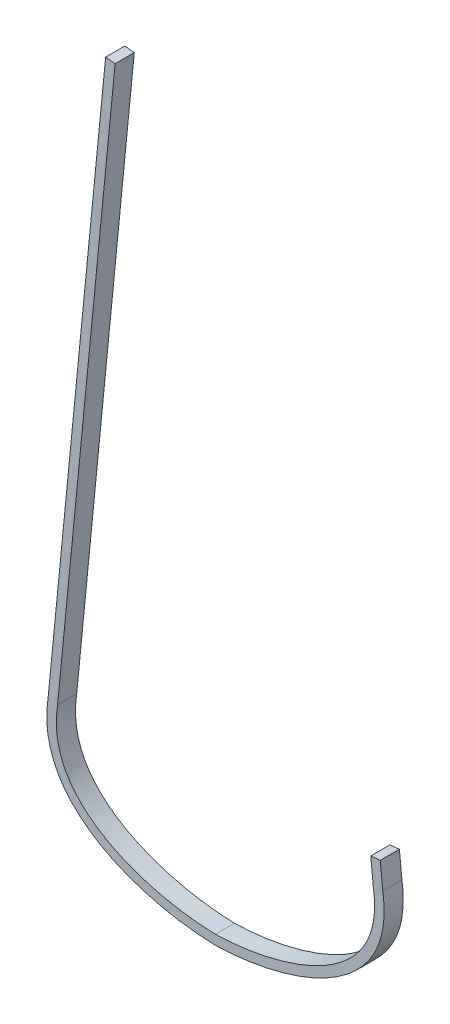
ISO-10303-21;
HEADER;
FILE_DESCRIPTION(('STEP AP214'),'2;1');
FILE_NAME('part.step','',(''),(''),'','','');
FILE_SCHEMA(('AUTOMOTIVE_DESIGN { 1 0 10303 214 1 1 1 1 }'));
ENDSEC;
DATA;
#1=APPLICATION_CONTEXT('core data for automotive mechanical design processes');
#2=APPLICATION_PROTOCOL_DEFINITION('international standard','automotive_design',2000,#1);
#3=PRODUCT_CONTEXT('',#1,'mechanical');
#4=PRODUCT('Part','Part','',(#3));
#5=PRODUCT_RELATED_PRODUCT_CATEGORY('part','',(#4));
#6=PRODUCT_DEFINITION_FORMATION('','',#4);
#7=PRODUCT_DEFINITION_CONTEXT('part definition',#1,'design');
#8=PRODUCT_DEFINITION('design','',#6,#7);
#9=PRODUCT_DEFINITION_SHAPE('','',#8);
#10=(LENGTH_UNIT() NAMED_UNIT(*) SI_UNIT(.MILLI.,.METRE.));
#11=(NAMED_UNIT(*) PLANE_ANGLE_UNIT() SI_UNIT($,.RADIAN.));
#12=(NAMED_UNIT(*) SI_UNIT($,.STERADIAN.) SOLID_ANGLE_UNIT());
#13=UNCERTAINTY_MEASURE_WITH_UNIT(LENGTH_MEASURE(1.E-05),#10,'distance_accuracy_value','');
#14=(GEOMETRIC_REPRESENTATION_CONTEXT(3) GLOBAL_UNCERTAINTY_ASSIGNED_CONTEXT((#13)) GLOBAL_UNIT_ASSIGNED_CONTEXT((#10,
#11,#12)) REPRESENTATION_CONTEXT('',''));
#15=CARTESIAN_POINT('',(0.,0.,0.));
#16=DIRECTION('',(0.,0.,1.));
#17=DIRECTION('',(1.,0.,0.));
#18=AXIS2_PLACEMENT_3D('',#15,#16,#17);
#19=CARTESIAN_POINT('',(0.,0.,19.05));
#20=CARTESIAN_POINT('',(73.6665806217367,1.74067599176395,19.05));
#21=CARTESIAN_POINT('',(181.188092360691,36.2008356091117,19.05));
#22=CARTESIAN_POINT('',(166.6875,130.175,19.05));
#23=B_SPLINE_CURVE_WITH_KNOTS('',3,(#19,#20,#21,#22),.UNSPECIFIED.,.F.,.F.,(4,4),(0.,1.),.UNSPECIFIED.);
#24=DIRECTION('',(0.,0.,-1.));
#25=VECTOR('',#24,1.);
#26=SURFACE_OF_LINEAR_EXTRUSION('',#23,#25);
#27=CARTESIAN_POINT('',(0.,0.,0.));
#28=CARTESIAN_POINT('',(73.6665806217367,1.74067599176395,0.));
#29=CARTESIAN_POINT('',(181.188092360691,36.2008356091117,0.));
#30=CARTESIAN_POINT('',(166.6875,130.175,0.));
#31=B_SPLINE_CURVE_WITH_KNOTS('',3,(#27,#28,#29,#30),.UNSPECIFIED.,.F.,.F.,(4,4),(0.,1.),.UNSPECIFIED.);
#32=CARTESIAN_POINT('',(0.,0.,0.));
#33=VERTEX_POINT('',#32);
#34=CARTESIAN_POINT('',(166.6875,130.175,0.));
#35=VERTEX_POINT('',#34);
#36=EDGE_CURVE('E145',#33,#35,#31,.T.);
#37=ORIENTED_EDGE('',*,*,#36,.T.);
#38=DIRECTION('',(0.,0.,-1.));
#39=VECTOR('',#38,1.);
#40=CARTESIAN_POINT('',(166.6875,130.175,19.05));
#41=LINE('',#40,#39);
#42=CARTESIAN_POINT('',(166.6875,130.175,19.05));
#43=VERTEX_POINT('',#42);
#44=EDGE_CURVE('E11',#43,#35,#41,.T.);
#45=ORIENTED_EDGE('',*,*,#44,.F.);
#46=CARTESIAN_POINT('',(0.,0.,19.05));
#47=VERTEX_POINT('',#46);
#48=EDGE_CURVE('E194',#47,#43,#23,.T.);
#49=ORIENTED_EDGE('',*,*,#48,.F.);
#50=DIRECTION('',(0.,0.,-1.));
#51=VECTOR('',#50,1.);
#52=CARTESIAN_POINT('',(0.,0.,19.05));
#53=LINE('',#52,#51);
#54=EDGE_CURVE('E138',#47,#33,#53,.T.);
#55=ORIENTED_EDGE('',*,*,#54,.T.);
#56=EDGE_LOOP('',(#37,#45,#49,#55));
#57=FACE_BOUND('',#56,.T.);
#58=ADVANCED_FACE('F33',(#57),#26,.F.);
#59=CARTESIAN_POINT('',(166.6875,130.175,19.05));
#60=DIRECTION('',(-0.995175000159784,-0.0981158450861778,0.));
#61=DIRECTION('',(0.0981158450861778,-0.995175000159784,0.));
#62=AXIS2_PLACEMENT_3D('',#59,#60,#61);
#63=PLANE('',#62);
#64=DIRECTION('',(-0.0981158450861778,0.995175000159783,0.));
#65=VECTOR('',#64,1.);
#66=CARTESIAN_POINT('',(166.6875,130.175,0.));
#67=LINE('',#66,#65);
#68=CARTESIAN_POINT('',(164.195357534811,155.452445004058,0.));
#69=VERTEX_POINT('',#68);
#70=EDGE_CURVE('E236',#35,#69,#67,.T.);
#71=ORIENTED_EDGE('',*,*,#70,.T.);
#72=DIRECTION('',(0.,0.,-1.));
#73=VECTOR('',#72,1.);
#74=CARTESIAN_POINT('',(164.195357534811,155.452445004058,19.05));
#75=LINE('',#74,#73);
#76=CARTESIAN_POINT('',(164.195357534811,155.452445004058,19.05));
#77=VERTEX_POINT('',#76);
#78=EDGE_CURVE('E42',#77,#69,#75,.T.);
#79=ORIENTED_EDGE('',*,*,#78,.F.);
#80=DIRECTION('',(-0.0981158450861778,0.995175000159783,0.));
#81=VECTOR('',#80,1.);
#82=CARTESIAN_POINT('',(166.6875,130.175,19.05));
#83=LINE('',#82,#81);
#84=EDGE_CURVE('E99',#43,#77,#83,.T.);
#85=ORIENTED_EDGE('',*,*,#84,.F.);
#86=ORIENTED_EDGE('',*,*,#44,.T.);
#87=EDGE_LOOP('',(#71,#79,#85,#86));
#88=FACE_BOUND('',#87,.T.);
#89=ADVANCED_FACE('F262',(#88),#63,.F.);
#90=CARTESIAN_POINT('',(154.716315658289,154.517891579613,19.05));
#91=DIRECTION('',(0.0981158450861753,-0.995175000159784,0.));
#92=DIRECTION('',(0.995175000159784,0.0981158450861754,0.));
#93=AXIS2_PLACEMENT_3D('',#90,#91,#92);
#94=PLANE('',#93);
#95=DIRECTION('',(-0.995175000159784,-0.0981158450861753,0.));
#96=VECTOR('',#95,1.);
#97=CARTESIAN_POINT('',(154.716315658289,154.517891579613,0.));
#98=LINE('',#97,#96);
#99=CARTESIAN_POINT('',(154.716315658289,154.517891579613,0.));
#100=VERTEX_POINT('',#99);
#101=EDGE_CURVE('E232',#69,#100,#98,.T.);
#102=ORIENTED_EDGE('',*,*,#101,.T.);
#103=DIRECTION('',(0.,0.,-1.));
#104=VECTOR('',#103,1.);
#105=CARTESIAN_POINT('',(154.716315658289,154.517891579613,19.05));
#106=LINE('',#105,#104);
#107=CARTESIAN_POINT('',(154.716315658289,154.517891579613,19.05));
#108=VERTEX_POINT('',#107);
#109=EDGE_CURVE('E224',#108,#100,#106,.T.);
#110=ORIENTED_EDGE('',*,*,#109,.F.);
#111=DIRECTION('',(-0.995175000159784,-0.0981158450861753,0.));
#112=VECTOR('',#111,1.);
#113=CARTESIAN_POINT('',(154.716315658289,154.517891579613,19.05));
#114=LINE('',#113,#112);
#115=EDGE_CURVE('E192',#77,#108,#114,.T.);
#116=ORIENTED_EDGE('',*,*,#115,.F.);
#117=ORIENTED_EDGE('',*,*,#78,.T.);
#118=EDGE_LOOP('',(#102,#110,#116,#117));
#119=FACE_BOUND('',#118,.T.);
#120=ADVANCED_FACE('F230',(#119),#94,.F.);
#121=CARTESIAN_POINT('',(157.23408188197,128.980548453709,19.05));
#122=DIRECTION('',(0.995175000159784,0.0981158450861758,0.));
#123=DIRECTION('',(-0.0981158450861759,0.995175000159784,0.));
#124=AXIS2_PLACEMENT_3D('',#121,#122,#123);
#125=PLANE('',#124);
#126=DIRECTION('',(0.0981158450861758,-0.995175000159784,0.));
#127=VECTOR('',#126,1.);
#128=CARTESIAN_POINT('',(157.23408188197,128.980548453709,0.));
#129=LINE('',#128,#127);
#130=CARTESIAN_POINT('',(157.23408188197,128.980548453709,0.));
#131=VERTEX_POINT('',#130);
#132=EDGE_CURVE('E238',#100,#131,#129,.T.);
#133=ORIENTED_EDGE('',*,*,#132,.T.);
#134=DIRECTION('',(0.,0.,-1.));
#135=VECTOR('',#134,1.);
#136=CARTESIAN_POINT('',(157.23408188197,128.980548453709,19.05));
#137=LINE('',#136,#135);
#138=CARTESIAN_POINT('',(157.23408188197,128.980548453709,19.05));
#139=VERTEX_POINT('',#138);
#140=EDGE_CURVE('E221',#139,#131,#137,.T.);
#141=ORIENTED_EDGE('',*,*,#140,.F.);
#142=DIRECTION('',(0.0981158450861758,-0.995175000159784,0.));
#143=VECTOR('',#142,1.);
#144=CARTESIAN_POINT('',(157.23408188197,128.980548453709,19.05));
#145=LINE('',#144,#143);
#146=EDGE_CURVE('E187',#108,#139,#145,.T.);
#147=ORIENTED_EDGE('',*,*,#146,.F.);
#148=ORIENTED_EDGE('',*,*,#109,.T.);
#149=EDGE_LOOP('',(#133,#141,#147,#148));
#150=FACE_BOUND('',#149,.T.);
#151=ADVANCED_FACE('F268',(#150),#125,.F.);
#152=CARTESIAN_POINT('',(157.23408188197,128.980548453709,19.05));
#153=CARTESIAN_POINT('',(157.261207353425,128.80475608259,19.05));
#154=CARTESIAN_POINT('',(157.316566229368,128.44670539477,19.05));
#155=CARTESIAN_POINT('',(157.415798732615,127.781927865814,19.05));
#156=CARTESIAN_POINT('',(157.584058118054,126.601085874369,19.05));
#157=CARTESIAN_POINT('',(157.881730698016,124.277278240634,19.05));
#158=CARTESIAN_POINT('',(158.206421640057,121.010360534751,19.05));
#159=CARTESIAN_POINT('',(158.437150465931,117.190167218602,19.05));
#160=CARTESIAN_POINT('',(158.540175043748,112.221426054033,19.05));
#161=CARTESIAN_POINT('',(158.296409220294,106.242287004757,19.05));
#162=CARTESIAN_POINT('',(157.442658539271,99.4182067892226,19.05));
#163=CARTESIAN_POINT('',(156.058613173129,92.923629982478,19.05));
#164=CARTESIAN_POINT('',(153.541361304269,84.6740226733845,19.05));
#165=CARTESIAN_POINT('',(149.192253507085,75.0755375544253,19.05));
#166=CARTESIAN_POINT('',(142.189146148936,64.5645369341676,19.05));
#167=CARTESIAN_POINT('',(130.643933927823,51.8035577227428,19.05));
#168=CARTESIAN_POINT('',(112.436111513656,38.1574524872599,19.05));
#169=CARTESIAN_POINT('',(90.5158541949529,27.6265370641219,19.05));
#170=CARTESIAN_POINT('',(71.6896130592172,21.0508508509878,19.05));
#171=CARTESIAN_POINT('',(57.16523288768,17.0231489798574,19.05));
#172=CARTESIAN_POINT('',(42.4774975697848,13.8758580326201,19.05));
#173=CARTESIAN_POINT('',(30.3032357230849,11.9623162671414,19.05));
#174=CARTESIAN_POINT('',(20.7254590356733,10.8404413717739,19.05));
#175=CARTESIAN_POINT('',(13.6522104162235,10.1989584372761,19.05));
#176=CARTESIAN_POINT('',(7.88003948147285,9.82720773209708,19.05));
#177=CARTESIAN_POINT('',(3.34047289736703,9.62475505591648,19.05));
#178=CARTESIAN_POINT('',(1.11761160220118,9.55519319222505,19.05));
#179=CARTESIAN_POINT('',(0.,9.52776173986118,19.05));
#180=B_SPLINE_CURVE_WITH_KNOTS('',3,(#152,#153,#154,#155,#156,#157,#158,#159,#160,#161,#162,
#163,#164,#165,#166,#167,#168,#169,#170,#171,#172,#173,#174,#175,#176,#177,#178,#179),
.UNSPECIFIED.,.F.,.F.,(4,1,1,1,1,1,1,1,1,1,1,1,1,1,1,1,1,1,1,1,1,1,1,1,1,4),
(0.00105703595463424,0.00300988454184536,0.00496273312905637,0.0088684303034785,
0.0166798246523227,0.0323026133500111,0.0479254020476996,0.063548190745388,0.0947937681407649,
0.126039345536142,0.157284922931519,0.188530500326895,0.251021655117649,0.313512809908403,
0.376003964699156,0.500986274280664,0.625968583862171,0.688459738652925,0.750950893443679,
0.813442048234432,0.875933203025186,0.907178780420563,0.93842435781594,0.969669935211317,
0.985292723909005,1.00091551260669),.UNSPECIFIED.);
#181=DIRECTION('',(0.,0.,-1.));
#182=VECTOR('',#181,1.);
#183=SURFACE_OF_LINEAR_EXTRUSION('',#180,#182);
#184=CARTESIAN_POINT('',(157.23408188197,128.980548453709,0.));
#185=CARTESIAN_POINT('',(157.261207353425,128.80475608259,0.));
#186=CARTESIAN_POINT('',(157.316566229368,128.44670539477,0.));
#187=CARTESIAN_POINT('',(157.415798732615,127.781927865814,0.));
#188=CARTESIAN_POINT('',(157.584058118054,126.601085874369,0.));
#189=CARTESIAN_POINT('',(157.881730698016,124.277278240634,0.));
#190=CARTESIAN_POINT('',(158.206421640057,121.010360534751,0.));
#191=CARTESIAN_POINT('',(158.437150465931,117.190167218602,0.));
#192=CARTESIAN_POINT('',(158.540175043748,112.221426054033,0.));
#193=CARTESIAN_POINT('',(158.296409220294,106.242287004757,0.));
#194=CARTESIAN_POINT('',(157.442658539271,99.4182067892226,0.));
#195=CARTESIAN_POINT('',(156.058613173129,92.923629982478,0.));
#196=CARTESIAN_POINT('',(153.541361304269,84.6740226733845,0.));
#197=CARTESIAN_POINT('',(149.192253507085,75.0755375544253,0.));
#198=CARTESIAN_POINT('',(142.189146148936,64.5645369341676,0.));
#199=CARTESIAN_POINT('',(130.643933927823,51.8035577227428,0.));
#200=CARTESIAN_POINT('',(112.436111513656,38.1574524872599,0.));
#201=CARTESIAN_POINT('',(90.5158541949529,27.6265370641219,0.));
#202=CARTESIAN_POINT('',(71.6896130592172,21.0508508509878,0.));
#203=CARTESIAN_POINT('',(57.16523288768,17.0231489798574,0.));
#204=CARTESIAN_POINT('',(42.4774975697848,13.8758580326201,0.));
#205=CARTESIAN_POINT('',(30.3032357230849,11.9623162671414,0.));
#206=CARTESIAN_POINT('',(20.7254590356733,10.8404413717739,0.));
#207=CARTESIAN_POINT('',(13.6522104162235,10.1989584372761,0.));
#208=CARTESIAN_POINT('',(7.88003948147285,9.82720773209708,0.));
#209=CARTESIAN_POINT('',(3.34047289736703,9.62475505591648,0.));
#210=CARTESIAN_POINT('',(1.11761160220118,9.55519319222505,0.));
#211=CARTESIAN_POINT('',(0.,9.52776173986118,0.));
#212=B_SPLINE_CURVE_WITH_KNOTS('',3,(#184,#185,#186,#187,#188,#189,#190,#191,#192,#193,#194,
#195,#196,#197,#198,#199,#200,#201,#202,#203,#204,#205,#206,#207,#208,#209,#210,#211),
.UNSPECIFIED.,.F.,.F.,(4,1,1,1,1,1,1,1,1,1,1,1,1,1,1,1,1,1,1,1,1,1,1,1,1,4),
(0.00105703595463424,0.00300988454184536,0.00496273312905637,0.0088684303034785,
0.0166798246523227,0.0323026133500111,0.0479254020476996,0.063548190745388,0.0947937681407649,
0.126039345536142,0.157284922931519,0.188530500326895,0.251021655117649,0.313512809908403,
0.376003964699156,0.500986274280664,0.625968583862171,0.688459738652925,0.750950893443679,
0.813442048234432,0.875933203025186,0.907178780420563,0.93842435781594,0.969669935211317,
0.985292723909005,1.00091551260669),.UNSPECIFIED.);
#213=CARTESIAN_POINT('',(0.,9.52776173986118,0.));
#214=VERTEX_POINT('',#213);
#215=EDGE_CURVE('E240',#131,#214,#212,.T.);
#216=ORIENTED_EDGE('',*,*,#215,.T.);
#217=DIRECTION('',(0.,0.,-1.));
#218=VECTOR('',#217,1.);
#219=CARTESIAN_POINT('',(0.,9.52776173986118,19.05));
#220=LINE('',#219,#218);
#221=CARTESIAN_POINT('',(0.,9.52776173986118,19.05));
#222=VERTEX_POINT('',#221);
#223=EDGE_CURVE('E218',#222,#214,#220,.T.);
#224=ORIENTED_EDGE('',*,*,#223,.F.);
#225=EDGE_CURVE('E179',#139,#222,#180,.T.);
#226=ORIENTED_EDGE('',*,*,#225,.F.);
#227=ORIENTED_EDGE('',*,*,#140,.T.);
#228=EDGE_LOOP('',(#216,#224,#226,#227));
#229=FACE_BOUND('',#228,.T.);
#230=ADVANCED_FACE('F171',(#229),#183,.F.);
#231=CARTESIAN_POINT('',(0.,9.52776173986118,19.05));
#232=CARTESIAN_POINT('',(-1.11761160220116,9.55519319222505,19.05));
#233=CARTESIAN_POINT('',(-3.34047289736702,9.62475505591649,19.05));
#234=CARTESIAN_POINT('',(-7.88003948147277,9.82720773209708,19.05));
#235=CARTESIAN_POINT('',(-13.6522104162235,10.1989584372761,19.05));
#236=CARTESIAN_POINT('',(-20.7254590356733,10.8404413717739,19.05));
#237=CARTESIAN_POINT('',(-30.303235723085,11.9623162671414,19.05));
#238=CARTESIAN_POINT('',(-42.4774975697847,13.8758580326201,19.05));
#239=CARTESIAN_POINT('',(-57.16523288768,17.0231489798574,19.05));
#240=CARTESIAN_POINT('',(-71.6896130592172,21.0508508509878,19.05));
#241=CARTESIAN_POINT('',(-90.5158541949528,27.6265370641219,19.05));
#242=CARTESIAN_POINT('',(-112.436111513656,38.1574524872599,19.05));
#243=CARTESIAN_POINT('',(-130.643933927824,51.8035577227429,19.05));
#244=CARTESIAN_POINT('',(-142.189146148936,64.5645369341677,19.05));
#245=CARTESIAN_POINT('',(-149.192253507085,75.0755375544254,19.05));
#246=CARTESIAN_POINT('',(-153.541361304269,84.6740226733847,19.05));
#247=CARTESIAN_POINT('',(-156.058613173129,92.9236299824781,19.05));
#248=CARTESIAN_POINT('',(-157.442658539271,99.4182067892228,19.05));
#249=CARTESIAN_POINT('',(-158.296409220294,106.242287004757,19.05));
#250=CARTESIAN_POINT('',(-158.540175043748,112.221426054033,19.05));
#251=CARTESIAN_POINT('',(-158.437150465931,117.190167218602,19.05));
#252=CARTESIAN_POINT('',(-158.206421640056,121.010360534751,19.05));
#253=CARTESIAN_POINT('',(-157.881730698017,124.277278240634,19.05));
#254=CARTESIAN_POINT('',(-157.584058118053,126.601085874369,19.05));
#255=CARTESIAN_POINT('',(-157.415798732615,127.781927865814,19.05));
#256=CARTESIAN_POINT('',(-157.316566229367,128.44670539477,19.05));
#257=CARTESIAN_POINT('',(-157.261207353425,128.80475608259,19.05));
#258=CARTESIAN_POINT('',(-157.23408188197,128.980548453709,19.05));
#259=B_SPLINE_CURVE_WITH_KNOTS('',3,(#231,#232,#233,#234,#235,#236,#237,#238,#239,#240,#241,
#242,#243,#244,#245,#246,#247,#248,#249,#250,#251,#252,#253,#254,#255,#256,#257,#258),
.UNSPECIFIED.,.F.,.F.,(4,1,1,1,1,1,1,1,1,1,1,1,1,1,1,1,1,1,1,1,1,1,1,1,1,4),
(0.00105703595463399,0.0166798246523224,0.0323026133500109,0.0635481907453877,
0.0947937681407646,0.126039345536141,0.188530500326895,0.251021655117649,0.313512809908403,
0.376003964699157,0.500986274280664,0.625968583862172,0.688459738652925,0.750950893443679,
0.813442048234433,0.84468762562981,0.875933203025187,0.907178780420563,0.93842435781594,
0.954047146513629,0.969669935211317,0.985292723909006,0.99310411825785,0.997009815432272,
0.998962664019483,1.00091551260669),.UNSPECIFIED.);
#260=DIRECTION('',(0.,0.,-1.));
#261=VECTOR('',#260,1.);
#262=SURFACE_OF_LINEAR_EXTRUSION('',#259,#261);
#263=CARTESIAN_POINT('',(0.,9.52776173986118,0.));
#264=CARTESIAN_POINT('',(-1.11761160220116,9.55519319222505,0.));
#265=CARTESIAN_POINT('',(-3.34047289736702,9.62475505591649,0.));
#266=CARTESIAN_POINT('',(-7.88003948147277,9.82720773209708,0.));
#267=CARTESIAN_POINT('',(-13.6522104162235,10.1989584372761,0.));
#268=CARTESIAN_POINT('',(-20.7254590356733,10.8404413717739,0.));
#269=CARTESIAN_POINT('',(-30.303235723085,11.9623162671414,0.));
#270=CARTESIAN_POINT('',(-42.4774975697847,13.8758580326201,0.));
#271=CARTESIAN_POINT('',(-57.16523288768,17.0231489798574,0.));
#272=CARTESIAN_POINT('',(-71.6896130592172,21.0508508509878,0.));
#273=CARTESIAN_POINT('',(-90.5158541949528,27.6265370641219,0.));
#274=CARTESIAN_POINT('',(-112.436111513656,38.1574524872599,0.));
#275=CARTESIAN_POINT('',(-130.643933927824,51.8035577227429,0.));
#276=CARTESIAN_POINT('',(-142.189146148936,64.5645369341677,0.));
#277=CARTESIAN_POINT('',(-149.192253507085,75.0755375544254,0.));
#278=CARTESIAN_POINT('',(-153.541361304269,84.6740226733847,0.));
#279=CARTESIAN_POINT('',(-156.058613173129,92.9236299824781,0.));
#280=CARTESIAN_POINT('',(-157.442658539271,99.4182067892228,0.));
#281=CARTESIAN_POINT('',(-158.296409220294,106.242287004757,0.));
#282=CARTESIAN_POINT('',(-158.540175043748,112.221426054033,0.));
#283=CARTESIAN_POINT('',(-158.437150465931,117.190167218602,0.));
#284=CARTESIAN_POINT('',(-158.206421640056,121.010360534751,0.));
#285=CARTESIAN_POINT('',(-157.881730698017,124.277278240634,0.));
#286=CARTESIAN_POINT('',(-157.584058118053,126.601085874369,0.));
#287=CARTESIAN_POINT('',(-157.415798732615,127.781927865814,0.));
#288=CARTESIAN_POINT('',(-157.316566229367,128.44670539477,0.));
#289=CARTESIAN_POINT('',(-157.261207353425,128.80475608259,0.));
#290=CARTESIAN_POINT('',(-157.23408188197,128.980548453709,0.));
#291=B_SPLINE_CURVE_WITH_KNOTS('',3,(#263,#264,#265,#266,#267,#268,#269,#270,#271,#272,#273,
#274,#275,#276,#277,#278,#279,#280,#281,#282,#283,#284,#285,#286,#287,#288,#289,#290),
.UNSPECIFIED.,.F.,.F.,(4,1,1,1,1,1,1,1,1,1,1,1,1,1,1,1,1,1,1,1,1,1,1,1,1,4),
(0.00105703595463399,0.0166798246523224,0.0323026133500109,0.0635481907453877,
0.0947937681407646,0.126039345536141,0.188530500326895,0.251021655117649,0.313512809908403,
0.376003964699157,0.500986274280664,0.625968583862172,0.688459738652925,0.750950893443679,
0.813442048234433,0.84468762562981,0.875933203025187,0.907178780420563,0.93842435781594,
0.954047146513629,0.969669935211317,0.985292723909006,0.99310411825785,0.997009815432272,
0.998962664019483,1.00091551260669),.UNSPECIFIED.);
#292=CARTESIAN_POINT('',(-157.23408188197,128.980548453709,0.));
#293=VERTEX_POINT('',#292);
#294=EDGE_CURVE('E246',#214,#293,#291,.T.);
#295=ORIENTED_EDGE('',*,*,#294,.T.);
#296=DIRECTION('',(0.,0.,-1.));
#297=VECTOR('',#296,1.);
#298=CARTESIAN_POINT('',(-157.23408188197,128.980548453709,19.05));
#299=LINE('',#298,#297);
#300=CARTESIAN_POINT('',(-157.23408188197,128.980548453709,19.05));
#301=VERTEX_POINT('',#300);
#302=EDGE_CURVE('E215',#301,#293,#299,.T.);
#303=ORIENTED_EDGE('',*,*,#302,.F.);
#304=EDGE_CURVE('E175',#222,#301,#259,.T.);
#305=ORIENTED_EDGE('',*,*,#304,.F.);
#306=ORIENTED_EDGE('',*,*,#223,.T.);
#307=EDGE_LOOP('',(#295,#303,#305,#306));
#308=FACE_BOUND('',#307,.T.);
#309=ADVANCED_FACE('F166',(#308),#262,.F.);
#310=CARTESIAN_POINT('',(-157.23408188197,128.980548453709,19.05));
#311=DIRECTION('',(-0.995175000159784,0.0981158450861758,0.));
#312=DIRECTION('',(-0.0981158450861758,-0.995175000159784,0.));
#313=AXIS2_PLACEMENT_3D('',#310,#311,#312);
#314=PLANE('',#313);
#315=DIRECTION('',(0.0981158450861758,0.995175000159784,0.));
#316=VECTOR('',#315,1.);
#317=CARTESIAN_POINT('',(-157.23408188197,128.980548453709,0.));
#318=LINE('',#317,#316);
#319=CARTESIAN_POINT('',(-99.8891814241341,710.6216816689,0.));
#320=VERTEX_POINT('',#319);
#321=EDGE_CURVE('E253',#293,#320,#318,.T.);
#322=ORIENTED_EDGE('',*,*,#321,.T.);
#323=DIRECTION('',(0.,0.,-1.));
#324=VECTOR('',#323,1.);
#325=CARTESIAN_POINT('',(-99.8891814241341,710.6216816689,19.05));
#326=LINE('',#325,#324);
#327=CARTESIAN_POINT('',(-99.8891814241341,710.6216816689,19.05));
#328=VERTEX_POINT('',#327);
#329=EDGE_CURVE('E133',#328,#320,#326,.T.);
#330=ORIENTED_EDGE('',*,*,#329,.F.);
#331=DIRECTION('',(0.0981158450861758,0.995175000159784,0.));
#332=VECTOR('',#331,1.);
#333=CARTESIAN_POINT('',(-157.23408188197,128.980548453709,19.05));
#334=LINE('',#333,#332);
#335=EDGE_CURVE('E124',#301,#328,#334,.T.);
#336=ORIENTED_EDGE('',*,*,#335,.F.);
#337=ORIENTED_EDGE('',*,*,#302,.T.);
#338=EDGE_LOOP('',(#322,#330,#336,#337));
#339=FACE_BOUND('',#338,.T.);
#340=ADVANCED_FACE('F163',(#339),#314,.F.);
#341=CARTESIAN_POINT('',(-109.368223300656,711.556235093346,19.05));
#342=DIRECTION('',(-0.0981158450861748,-0.995175000159784,0.));
#343=DIRECTION('',(0.995175000159784,-0.0981158450861748,0.));
#344=AXIS2_PLACEMENT_3D('',#341,#342,#343);
#345=PLANE('',#344);
#346=DIRECTION('',(-0.995175000159784,0.0981158450861748,0.));
#347=VECTOR('',#346,1.);
#348=CARTESIAN_POINT('',(-109.368223300656,711.556235093346,0.));
#349=LINE('',#348,#347);
#350=CARTESIAN_POINT('',(-109.368223300656,711.556235093346,0.));
#351=VERTEX_POINT('',#350);
#352=EDGE_CURVE('E132',#320,#351,#349,.T.);
#353=ORIENTED_EDGE('',*,*,#352,.T.);
#354=DIRECTION('',(0.,0.,-1.));
#355=VECTOR('',#354,1.);
#356=CARTESIAN_POINT('',(-109.368223300656,711.556235093346,19.05));
#357=LINE('',#356,#355);
#358=CARTESIAN_POINT('',(-109.368223300656,711.556235093346,19.05));
#359=VERTEX_POINT('',#358);
#360=EDGE_CURVE('E129',#359,#351,#357,.T.);
#361=ORIENTED_EDGE('',*,*,#360,.F.);
#362=DIRECTION('',(-0.995175000159784,0.0981158450861748,0.));
#363=VECTOR('',#362,1.);
#364=CARTESIAN_POINT('',(-109.368223300656,711.556235093346,19.05));
#365=LINE('',#364,#363);
#366=EDGE_CURVE('E118',#328,#359,#365,.T.);
#367=ORIENTED_EDGE('',*,*,#366,.F.);
#368=ORIENTED_EDGE('',*,*,#329,.T.);
#369=EDGE_LOOP('',(#353,#361,#367,#368));
#370=FACE_BOUND('',#369,.T.);
#371=ADVANCED_FACE('F130',(#370),#345,.F.);
#372=CARTESIAN_POINT('',(-166.6875,130.175,19.05));
#373=DIRECTION('',(0.995175000159784,-0.0981158450861758,0.));
#374=DIRECTION('',(0.0981158450861759,0.995175000159784,0.));
#375=AXIS2_PLACEMENT_3D('',#372,#373,#374);
#376=PLANE('',#375);
#377=DIRECTION('',(-0.0981158450861758,-0.995175000159784,0.));
#378=VECTOR('',#377,1.);
#379=CARTESIAN_POINT('',(-166.6875,130.175,0.));
#380=LINE('',#379,#378);
#381=CARTESIAN_POINT('',(-166.6875,130.175,0.));
#382=VERTEX_POINT('',#381);
#383=EDGE_CURVE('E85',#351,#382,#380,.T.);
#384=ORIENTED_EDGE('',*,*,#383,.T.);
#385=DIRECTION('',(0.,0.,-1.));
#386=VECTOR('',#385,1.);
#387=CARTESIAN_POINT('',(-166.6875,130.175,19.05));
#388=LINE('',#387,#386);
#389=CARTESIAN_POINT('',(-166.6875,130.175,19.05));
#390=VERTEX_POINT('',#389);
#391=EDGE_CURVE('E134',#390,#382,#388,.T.);
#392=ORIENTED_EDGE('',*,*,#391,.F.);
#393=DIRECTION('',(-0.0981158450861758,-0.995175000159784,0.));
#394=VECTOR('',#393,1.);
#395=CARTESIAN_POINT('',(-166.6875,130.175,19.05));
#396=LINE('',#395,#394);
#397=EDGE_CURVE('E122',#359,#390,#396,.T.);
#398=ORIENTED_EDGE('',*,*,#397,.F.);
#399=ORIENTED_EDGE('',*,*,#360,.T.);
#400=EDGE_LOOP('',(#384,#392,#398,#399));
#401=FACE_BOUND('',#400,.T.);
#402=ADVANCED_FACE('F136',(#401),#376,.F.);
#403=CARTESIAN_POINT('',(-166.6875,130.175,19.05));
#404=CARTESIAN_POINT('',(-181.188092360691,36.2008356091117,19.05));
#405=CARTESIAN_POINT('',(-73.6665806217367,1.74067599176395,19.05));
#406=CARTESIAN_POINT('',(0.,0.,19.05));
#407=B_SPLINE_CURVE_WITH_KNOTS('',3,(#403,#404,#405,#406),.UNSPECIFIED.,.F.,.F.,(4,4),(0.,1.),.UNSPECIFIED.);
#408=DIRECTION('',(0.,0.,-1.));
#409=VECTOR('',#408,1.);
#410=SURFACE_OF_LINEAR_EXTRUSION('',#407,#409);
#411=CARTESIAN_POINT('',(-166.6875,130.175,0.));
#412=CARTESIAN_POINT('',(-181.188092360691,36.2008356091117,0.));
#413=CARTESIAN_POINT('',(-73.6665806217367,1.74067599176395,0.));
#414=CARTESIAN_POINT('',(0.,0.,0.));
#415=B_SPLINE_CURVE_WITH_KNOTS('',3,(#411,#412,#413,#414),.UNSPECIFIED.,.F.,.F.,(4,4),(0.,1.),.UNSPECIFIED.);
#416=EDGE_CURVE('E91',#382,#33,#415,.T.);
#417=ORIENTED_EDGE('',*,*,#416,.T.);
#418=ORIENTED_EDGE('',*,*,#54,.F.);
#419=EDGE_CURVE('E50',#390,#47,#407,.T.);
#420=ORIENTED_EDGE('',*,*,#419,.F.);
#421=ORIENTED_EDGE('',*,*,#391,.T.);
#422=EDGE_LOOP('',(#417,#418,#420,#421));
#423=FACE_BOUND('',#422,.T.);
#424=ADVANCED_FACE('F153',(#423),#410,.F.);
#425=CARTESIAN_POINT('',(116.406439868411,30.4999418503284,19.05));
#426=DIRECTION('',(0.,0.,-1.));
#427=DIRECTION('',(-1.,0.,0.));
#428=AXIS2_PLACEMENT_3D('',#425,#426,#427);
#429=PLANE('',#428);
#430=ORIENTED_EDGE('',*,*,#48,.T.);
#431=ORIENTED_EDGE('',*,*,#84,.T.);
#432=ORIENTED_EDGE('',*,*,#115,.T.);
#433=ORIENTED_EDGE('',*,*,#146,.T.);
#434=ORIENTED_EDGE('',*,*,#225,.T.);
#435=ORIENTED_EDGE('',*,*,#304,.T.);
#436=ORIENTED_EDGE('',*,*,#335,.T.);
#437=ORIENTED_EDGE('',*,*,#366,.T.);
#438=ORIENTED_EDGE('',*,*,#397,.T.);
#439=ORIENTED_EDGE('',*,*,#419,.T.);
#440=EDGE_LOOP('',(#430,#431,#432,#433,#434,#435,#436,#437,#438,#439));
#441=FACE_BOUND('',#440,.T.);
#442=ADVANCED_FACE('F120',(#441),#429,.F.);
#443=CARTESIAN_POINT('',(116.406439868411,30.4999418503284,0.));
#444=DIRECTION('',(0.,0.,-1.));
#445=DIRECTION('',(-1.,0.,0.));
#446=AXIS2_PLACEMENT_3D('',#443,#444,#445);
#447=PLANE('',#446);
#448=ORIENTED_EDGE('',*,*,#36,.F.);
#449=ORIENTED_EDGE('',*,*,#416,.F.);
#450=ORIENTED_EDGE('',*,*,#383,.F.);
#451=ORIENTED_EDGE('',*,*,#352,.F.);
#452=ORIENTED_EDGE('',*,*,#321,.F.);
#453=ORIENTED_EDGE('',*,*,#294,.F.);
#454=ORIENTED_EDGE('',*,*,#215,.F.);
#455=ORIENTED_EDGE('',*,*,#132,.F.);
#456=ORIENTED_EDGE('',*,*,#101,.F.);
#457=ORIENTED_EDGE('',*,*,#70,.F.);
#458=EDGE_LOOP('',(#448,#449,#450,#451,#452,#453,#454,#455,#456,#457));
#459=FACE_BOUND('',#458,.T.);
#460=ADVANCED_FACE('F157',(#459),#447,.T.);
#461=CLOSED_SHELL('',(#58,#89,#120,#151,#230,#309,#340,#371,#402,#424,#442,#460));
#462=MANIFOLD_SOLID_BREP('B2',#461);
#463=ADVANCED_BREP_SHAPE_REPRESENTATION('',(#18,#462),#14);
#464=SHAPE_DEFINITION_REPRESENTATION(#9,#463);
ENDSEC;
END-ISO-10303-21;
